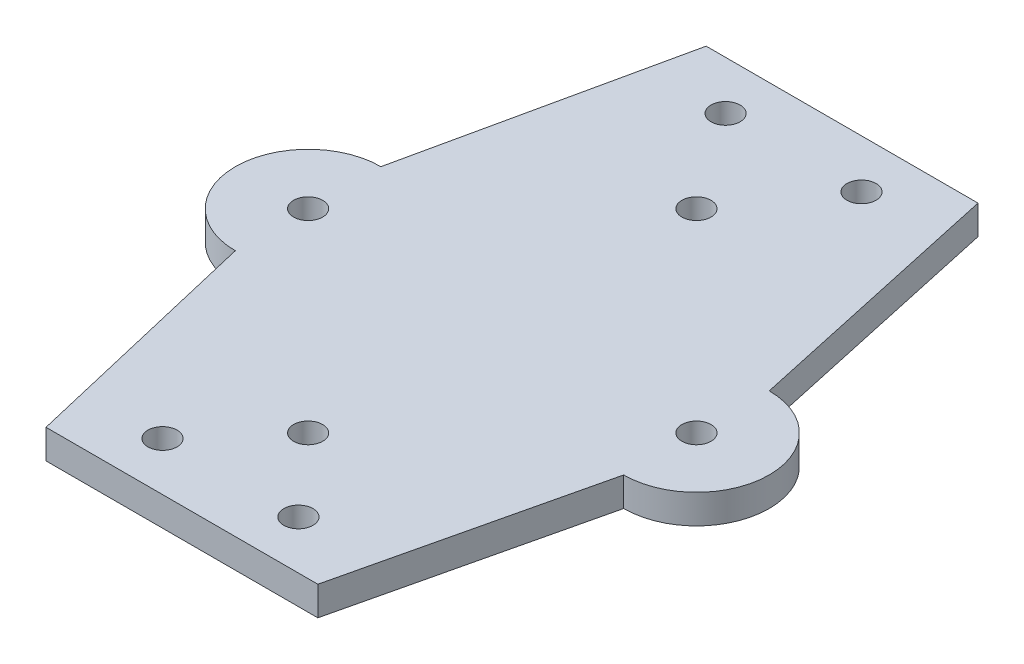
ISO-10303-21;
HEADER;
FILE_DESCRIPTION(('STEP AP214'),'2;1');
FILE_NAME('part.step','',(''),(''),'','','');
FILE_SCHEMA(('AUTOMOTIVE_DESIGN { 1 0 10303 214 1 1 1 1 }'));
ENDSEC;
DATA;
#1=APPLICATION_CONTEXT('core data for automotive mechanical design processes');
#2=APPLICATION_PROTOCOL_DEFINITION('international standard','automotive_design',2000,#1);
#3=PRODUCT_CONTEXT('',#1,'mechanical');
#4=PRODUCT('Part','Part','',(#3));
#5=PRODUCT_RELATED_PRODUCT_CATEGORY('part','',(#4));
#6=PRODUCT_DEFINITION_FORMATION('','',#4);
#7=PRODUCT_DEFINITION_CONTEXT('part definition',#1,'design');
#8=PRODUCT_DEFINITION('design','',#6,#7);
#9=PRODUCT_DEFINITION_SHAPE('','',#8);
#10=(LENGTH_UNIT() NAMED_UNIT(*) SI_UNIT(.MILLI.,.METRE.));
#11=(NAMED_UNIT(*) PLANE_ANGLE_UNIT() SI_UNIT($,.RADIAN.));
#12=(NAMED_UNIT(*) SI_UNIT($,.STERADIAN.) SOLID_ANGLE_UNIT());
#13=UNCERTAINTY_MEASURE_WITH_UNIT(LENGTH_MEASURE(1.E-05),#10,'distance_accuracy_value','');
#14=(GEOMETRIC_REPRESENTATION_CONTEXT(3) GLOBAL_UNCERTAINTY_ASSIGNED_CONTEXT((#13)) GLOBAL_UNIT_ASSIGNED_CONTEXT((#10,
#11,#12)) REPRESENTATION_CONTEXT('',''));
#15=CARTESIAN_POINT('',(0.,0.,0.));
#16=DIRECTION('',(0.,0.,1.));
#17=DIRECTION('',(1.,0.,0.));
#18=AXIS2_PLACEMENT_3D('',#15,#16,#17);
#19=CARTESIAN_POINT('',(20.653202903124,-1.5,-4.50615336068161));
#20=DIRECTION('',(0.977015761409992,0.,-0.213167075216726));
#21=DIRECTION('',(-0.213167075216726,0.,-0.977015761409992));
#22=AXIS2_PLACEMENT_3D('',#19,#20,#21);
#23=PLANE('',#22);
#24=DIRECTION('',(0.,1.,0.));
#25=VECTOR('',#24,1.);
#26=CARTESIAN_POINT('',(14.,-1.5,-35.));
#27=LINE('',#26,#25);
#28=CARTESIAN_POINT('',(14.,-1.5,-35.));
#29=VERTEX_POINT('',#28);
#30=CARTESIAN_POINT('',(14.,1.5,-35.));
#31=VERTEX_POINT('',#30);
#32=EDGE_CURVE('E38',#29,#31,#27,.T.);
#33=ORIENTED_EDGE('',*,*,#32,.T.);
#34=DIRECTION('',(-0.213167075216726,0.,-0.977015761409992));
#35=VECTOR('',#34,1.);
#36=CARTESIAN_POINT('',(20.653202903124,1.5,-4.50615336068161));
#37=LINE('',#36,#35);
#38=CARTESIAN_POINT('',(20.,1.5,-7.50000000000001));
#39=VERTEX_POINT('',#38);
#40=EDGE_CURVE('E100',#39,#31,#37,.T.);
#41=ORIENTED_EDGE('',*,*,#40,.F.);
#42=DIRECTION('',(0.,1.,0.));
#43=VECTOR('',#42,1.);
#44=CARTESIAN_POINT('',(20.,-1.5,-7.50000000000001));
#45=LINE('',#44,#43);
#46=CARTESIAN_POINT('',(20.,-1.5,-7.50000000000001));
#47=VERTEX_POINT('',#46);
#48=EDGE_CURVE('E11',#47,#39,#45,.T.);
#49=ORIENTED_EDGE('',*,*,#48,.F.);
#50=DIRECTION('',(-0.213167075216726,0.,-0.977015761409992));
#51=VECTOR('',#50,1.);
#52=CARTESIAN_POINT('',(20.653202903124,-1.5,-4.50615336068161));
#53=LINE('',#52,#51);
#54=EDGE_CURVE('E102',#47,#29,#53,.T.);
#55=ORIENTED_EDGE('',*,*,#54,.T.);
#56=EDGE_LOOP('',(#33,#41,#49,#55));
#57=FACE_BOUND('',#56,.T.);
#58=ADVANCED_FACE('F34',(#57),#23,.T.);
#59=CARTESIAN_POINT('',(20.,-1.5,0.));
#60=DIRECTION('',(0.,1.,0.));
#61=DIRECTION('',(0.,0.,1.));
#62=AXIS2_PLACEMENT_3D('',#59,#60,#61);
#63=CYLINDRICAL_SURFACE('',#62,7.5);
#64=ORIENTED_EDGE('',*,*,#48,.T.);
#65=CARTESIAN_POINT('',(20.,1.5,0.));
#66=DIRECTION('',(0.,1.,0.));
#67=DIRECTION('',(0.,0.,1.));
#68=AXIS2_PLACEMENT_3D('',#65,#66,#67);
#69=CIRCLE('',#68,7.5);
#70=CARTESIAN_POINT('',(20.,1.5,7.49999999999999));
#71=VERTEX_POINT('',#70);
#72=EDGE_CURVE('E116',#39,#71,#69,.F.);
#73=ORIENTED_EDGE('',*,*,#72,.T.);
#74=DIRECTION('',(0.,1.,0.));
#75=VECTOR('',#74,1.);
#76=CARTESIAN_POINT('',(20.,-1.5,7.49999999999999));
#77=LINE('',#76,#75);
#78=CARTESIAN_POINT('',(20.,-1.5,7.49999999999999));
#79=VERTEX_POINT('',#78);
#80=EDGE_CURVE('E43',#79,#71,#77,.T.);
#81=ORIENTED_EDGE('',*,*,#80,.F.);
#82=CARTESIAN_POINT('',(20.,-1.5,0.));
#83=DIRECTION('',(0.,1.,0.));
#84=DIRECTION('',(0.,0.,1.));
#85=AXIS2_PLACEMENT_3D('',#82,#83,#84);
#86=CIRCLE('',#85,7.5);
#87=EDGE_CURVE('E56',#47,#79,#86,.F.);
#88=ORIENTED_EDGE('',*,*,#87,.F.);
#89=EDGE_LOOP('',(#64,#73,#81,#88));
#90=FACE_BOUND('',#89,.T.);
#91=ADVANCED_FACE('F224',(#90),#63,.T.);
#92=CARTESIAN_POINT('',(20.6229508196721,-1.5,4.85245901639344));
#93=DIRECTION('',(0.973417168333576,0.,0.229039333725547));
#94=DIRECTION('',(0.229039333725547,0.,-0.973417168333576));
#95=AXIS2_PLACEMENT_3D('',#92,#93,#94);
#96=PLANE('',#95);
#97=ORIENTED_EDGE('',*,*,#80,.T.);
#98=DIRECTION('',(0.229039333725547,0.,-0.973417168333576));
#99=VECTOR('',#98,1.);
#100=CARTESIAN_POINT('',(20.6229508196721,1.5,4.85245901639344));
#101=LINE('',#100,#99);
#102=CARTESIAN_POINT('',(14.,1.5,33.));
#103=VERTEX_POINT('',#102);
#104=EDGE_CURVE('E135',#103,#71,#101,.T.);
#105=ORIENTED_EDGE('',*,*,#104,.F.);
#106=DIRECTION('',(0.,1.,0.));
#107=VECTOR('',#106,1.);
#108=CARTESIAN_POINT('',(14.,-1.5,33.));
#109=LINE('',#108,#107);
#110=CARTESIAN_POINT('',(14.,-1.5,33.));
#111=VERTEX_POINT('',#110);
#112=EDGE_CURVE('E198',#111,#103,#109,.T.);
#113=ORIENTED_EDGE('',*,*,#112,.F.);
#114=DIRECTION('',(0.229039333725547,0.,-0.973417168333576));
#115=VECTOR('',#114,1.);
#116=CARTESIAN_POINT('',(20.6229508196721,-1.5,4.85245901639344));
#117=LINE('',#116,#115);
#118=EDGE_CURVE('E176',#111,#79,#117,.T.);
#119=ORIENTED_EDGE('',*,*,#118,.T.);
#120=EDGE_LOOP('',(#97,#105,#113,#119));
#121=FACE_BOUND('',#120,.T.);
#122=ADVANCED_FACE('F227',(#121),#96,.T.);
#123=CARTESIAN_POINT('',(0.,-1.5,33.));
#124=DIRECTION('',(0.,0.,-1.));
#125=DIRECTION('',(-1.,0.,0.));
#126=AXIS2_PLACEMENT_3D('',#123,#124,#125);
#127=PLANE('',#126);
#128=ORIENTED_EDGE('',*,*,#112,.T.);
#129=DIRECTION('',(-1.,0.,0.));
#130=VECTOR('',#129,1.);
#131=CARTESIAN_POINT('',(0.,1.5,33.));
#132=LINE('',#131,#130);
#133=CARTESIAN_POINT('',(-14.,1.5,33.));
#134=VERTEX_POINT('',#133);
#135=EDGE_CURVE('E132',#103,#134,#132,.T.);
#136=ORIENTED_EDGE('',*,*,#135,.T.);
#137=DIRECTION('',(0.,1.,0.));
#138=VECTOR('',#137,1.);
#139=CARTESIAN_POINT('',(-14.,-1.5,33.));
#140=LINE('',#139,#138);
#141=CARTESIAN_POINT('',(-14.,-1.5,33.));
#142=VERTEX_POINT('',#141);
#143=EDGE_CURVE('E200',#142,#134,#140,.T.);
#144=ORIENTED_EDGE('',*,*,#143,.F.);
#145=DIRECTION('',(-1.,0.,0.));
#146=VECTOR('',#145,1.);
#147=CARTESIAN_POINT('',(0.,-1.5,33.));
#148=LINE('',#147,#146);
#149=EDGE_CURVE('E173',#111,#142,#148,.T.);
#150=ORIENTED_EDGE('',*,*,#149,.F.);
#151=EDGE_LOOP('',(#128,#136,#144,#150));
#152=FACE_BOUND('',#151,.T.);
#153=ADVANCED_FACE('F220',(#152),#127,.F.);
#154=CARTESIAN_POINT('',(-20.6229508196721,-1.5,4.85245901639345));
#155=DIRECTION('',(0.973417168333576,0.,-0.229039333725547));
#156=DIRECTION('',(-0.229039333725547,0.,-0.973417168333576));
#157=AXIS2_PLACEMENT_3D('',#154,#155,#156);
#158=PLANE('',#157);
#159=ORIENTED_EDGE('',*,*,#143,.T.);
#160=DIRECTION('',(-0.229039333725547,0.,-0.973417168333576));
#161=VECTOR('',#160,1.);
#162=CARTESIAN_POINT('',(-20.6229508196721,1.5,4.85245901639345));
#163=LINE('',#162,#161);
#164=CARTESIAN_POINT('',(-20.,1.5,7.5));
#165=VERTEX_POINT('',#164);
#166=EDGE_CURVE('E129',#134,#165,#163,.T.);
#167=ORIENTED_EDGE('',*,*,#166,.T.);
#168=DIRECTION('',(0.,1.,0.));
#169=VECTOR('',#168,1.);
#170=CARTESIAN_POINT('',(-20.,-1.5,7.5));
#171=LINE('',#170,#169);
#172=CARTESIAN_POINT('',(-20.,-1.5,7.5));
#173=VERTEX_POINT('',#172);
#174=EDGE_CURVE('E202',#173,#165,#171,.T.);
#175=ORIENTED_EDGE('',*,*,#174,.F.);
#176=DIRECTION('',(-0.229039333725547,0.,-0.973417168333576));
#177=VECTOR('',#176,1.);
#178=CARTESIAN_POINT('',(-20.6229508196721,-1.5,4.85245901639345));
#179=LINE('',#178,#177);
#180=EDGE_CURVE('E171',#142,#173,#179,.T.);
#181=ORIENTED_EDGE('',*,*,#180,.F.);
#182=EDGE_LOOP('',(#159,#167,#175,#181));
#183=FACE_BOUND('',#182,.T.);
#184=ADVANCED_FACE('F216',(#183),#158,.F.);
#185=CARTESIAN_POINT('',(-20.,-1.5,0.));
#186=DIRECTION('',(0.,1.,0.));
#187=DIRECTION('',(0.,0.,1.));
#188=AXIS2_PLACEMENT_3D('',#185,#186,#187);
#189=CYLINDRICAL_SURFACE('',#188,7.5);
#190=ORIENTED_EDGE('',*,*,#174,.T.);
#191=CARTESIAN_POINT('',(-20.,1.5,0.));
#192=DIRECTION('',(0.,1.,0.));
#193=DIRECTION('',(0.,0.,1.));
#194=AXIS2_PLACEMENT_3D('',#191,#192,#193);
#195=CIRCLE('',#194,7.5);
#196=CARTESIAN_POINT('',(-20.,1.5,-7.5));
#197=VERTEX_POINT('',#196);
#198=EDGE_CURVE('E123',#197,#165,#195,.T.);
#199=ORIENTED_EDGE('',*,*,#198,.F.);
#200=DIRECTION('',(0.,1.,0.));
#201=VECTOR('',#200,1.);
#202=CARTESIAN_POINT('',(-20.,-1.5,-7.5));
#203=LINE('',#202,#201);
#204=CARTESIAN_POINT('',(-20.,-1.5,-7.5));
#205=VERTEX_POINT('',#204);
#206=EDGE_CURVE('E204',#205,#197,#203,.T.);
#207=ORIENTED_EDGE('',*,*,#206,.F.);
#208=CARTESIAN_POINT('',(-20.,-1.5,0.));
#209=DIRECTION('',(0.,1.,0.));
#210=DIRECTION('',(0.,0.,1.));
#211=AXIS2_PLACEMENT_3D('',#208,#209,#210);
#212=CIRCLE('',#211,7.5);
#213=EDGE_CURVE('E168',#205,#173,#212,.T.);
#214=ORIENTED_EDGE('',*,*,#213,.T.);
#215=EDGE_LOOP('',(#190,#199,#207,#214));
#216=FACE_BOUND('',#215,.T.);
#217=ADVANCED_FACE('F211',(#216),#189,.T.);
#218=CARTESIAN_POINT('',(-20.653202903124,-1.5,-4.50615336068161));
#219=DIRECTION('',(0.977015761409992,0.,0.213167075216726));
#220=DIRECTION('',(0.213167075216726,0.,-0.977015761409992));
#221=AXIS2_PLACEMENT_3D('',#218,#219,#220);
#222=PLANE('',#221);
#223=ORIENTED_EDGE('',*,*,#206,.T.);
#224=DIRECTION('',(0.213167075216726,0.,-0.977015761409992));
#225=VECTOR('',#224,1.);
#226=CARTESIAN_POINT('',(-20.653202903124,1.5,-4.50615336068161));
#227=LINE('',#226,#225);
#228=CARTESIAN_POINT('',(-14.,1.5,-35.));
#229=VERTEX_POINT('',#228);
#230=EDGE_CURVE('E121',#197,#229,#227,.T.);
#231=ORIENTED_EDGE('',*,*,#230,.T.);
#232=DIRECTION('',(0.,1.,0.));
#233=VECTOR('',#232,1.);
#234=CARTESIAN_POINT('',(-14.,-1.5,-35.));
#235=LINE('',#234,#233);
#236=CARTESIAN_POINT('',(-14.,-1.5,-35.));
#237=VERTEX_POINT('',#236);
#238=EDGE_CURVE('E105',#237,#229,#235,.T.);
#239=ORIENTED_EDGE('',*,*,#238,.F.);
#240=DIRECTION('',(0.213167075216726,0.,-0.977015761409992));
#241=VECTOR('',#240,1.);
#242=CARTESIAN_POINT('',(-20.653202903124,-1.5,-4.50615336068161));
#243=LINE('',#242,#241);
#244=EDGE_CURVE('E165',#205,#237,#243,.T.);
#245=ORIENTED_EDGE('',*,*,#244,.F.);
#246=EDGE_LOOP('',(#223,#231,#239,#245));
#247=FACE_BOUND('',#246,.T.);
#248=ADVANCED_FACE('F208',(#247),#222,.F.);
#249=CARTESIAN_POINT('',(-20.,-1.5,0.));
#250=DIRECTION('',(0.,1.,0.));
#251=DIRECTION('',(0.,0.,1.));
#252=AXIS2_PLACEMENT_3D('',#249,#250,#251);
#253=CYLINDRICAL_SURFACE('',#252,1.5);
#254=CARTESIAN_POINT('',(-20.,-1.5,0.));
#255=DIRECTION('',(0.,1.,0.));
#256=DIRECTION('',(0.,0.,1.));
#257=AXIS2_PLACEMENT_3D('',#254,#255,#256);
#258=CIRCLE('',#257,1.5);
#259=CARTESIAN_POINT('',(-20.,-1.5,1.5));
#260=VERTEX_POINT('',#259);
#261=EDGE_CURVE('E192',#260,#260,#258,.T.);
#262=ORIENTED_EDGE('',*,*,#261,.F.);
#263=EDGE_LOOP('',(#262));
#264=FACE_BOUND('',#263,.T.);
#265=CARTESIAN_POINT('',(-20.,1.5,0.));
#266=DIRECTION('',(0.,1.,0.));
#267=DIRECTION('',(0.,0.,1.));
#268=AXIS2_PLACEMENT_3D('',#265,#266,#267);
#269=CIRCLE('',#268,1.5);
#270=CARTESIAN_POINT('',(-20.,1.5,1.5));
#271=VERTEX_POINT('',#270);
#272=EDGE_CURVE('E150',#271,#271,#269,.T.);
#273=ORIENTED_EDGE('',*,*,#272,.T.);
#274=EDGE_LOOP('',(#273));
#275=FACE_BOUND('',#274,.T.);
#276=ADVANCED_FACE('F274',(#264,#275),#253,.F.);
#277=CARTESIAN_POINT('',(7.,-1.5,-30.));
#278=DIRECTION('',(0.,1.,0.));
#279=DIRECTION('',(0.,0.,1.));
#280=AXIS2_PLACEMENT_3D('',#277,#278,#279);
#281=CYLINDRICAL_SURFACE('',#280,1.5);
#282=CARTESIAN_POINT('',(7.,-1.5,-30.));
#283=DIRECTION('',(0.,1.,0.));
#284=DIRECTION('',(0.,0.,1.));
#285=AXIS2_PLACEMENT_3D('',#282,#283,#284);
#286=CIRCLE('',#285,1.5);
#287=CARTESIAN_POINT('',(7.,-1.5,-28.5));
#288=VERTEX_POINT('',#287);
#289=EDGE_CURVE('E189',#288,#288,#286,.F.);
#290=ORIENTED_EDGE('',*,*,#289,.T.);
#291=EDGE_LOOP('',(#290));
#292=FACE_BOUND('',#291,.T.);
#293=CARTESIAN_POINT('',(7.,1.5,-30.));
#294=DIRECTION('',(0.,1.,0.));
#295=DIRECTION('',(0.,0.,1.));
#296=AXIS2_PLACEMENT_3D('',#293,#294,#295);
#297=CIRCLE('',#296,1.5);
#298=CARTESIAN_POINT('',(7.,1.5,-28.5));
#299=VERTEX_POINT('',#298);
#300=EDGE_CURVE('E147',#299,#299,#297,.F.);
#301=ORIENTED_EDGE('',*,*,#300,.F.);
#302=EDGE_LOOP('',(#301));
#303=FACE_BOUND('',#302,.T.);
#304=ADVANCED_FACE('F277',(#292,#303),#281,.F.);
#305=CARTESIAN_POINT('',(7.00000000000002,-1.5,28.));
#306=DIRECTION('',(0.,1.,0.));
#307=DIRECTION('',(0.,0.,1.));
#308=AXIS2_PLACEMENT_3D('',#305,#306,#307);
#309=CYLINDRICAL_SURFACE('',#308,1.5);
#310=CARTESIAN_POINT('',(7.00000000000002,-1.5,28.));
#311=DIRECTION('',(0.,1.,0.));
#312=DIRECTION('',(0.,0.,1.));
#313=AXIS2_PLACEMENT_3D('',#310,#311,#312);
#314=CIRCLE('',#313,1.5);
#315=CARTESIAN_POINT('',(7.00000000000002,-1.5,29.5));
#316=VERTEX_POINT('',#315);
#317=EDGE_CURVE('E186',#316,#316,#314,.F.);
#318=ORIENTED_EDGE('',*,*,#317,.T.);
#319=EDGE_LOOP('',(#318));
#320=FACE_BOUND('',#319,.T.);
#321=CARTESIAN_POINT('',(7.00000000000002,1.5,28.));
#322=DIRECTION('',(0.,1.,0.));
#323=DIRECTION('',(0.,0.,1.));
#324=AXIS2_PLACEMENT_3D('',#321,#322,#323);
#325=CIRCLE('',#324,1.5);
#326=CARTESIAN_POINT('',(7.00000000000002,1.5,29.5));
#327=VERTEX_POINT('',#326);
#328=EDGE_CURVE('E144',#327,#327,#325,.F.);
#329=ORIENTED_EDGE('',*,*,#328,.F.);
#330=EDGE_LOOP('',(#329));
#331=FACE_BOUND('',#330,.T.);
#332=ADVANCED_FACE('F281',(#320,#331),#309,.F.);
#333=CARTESIAN_POINT('',(-7.,-1.5,-30.));
#334=DIRECTION('',(0.,1.,0.));
#335=DIRECTION('',(0.,0.,1.));
#336=AXIS2_PLACEMENT_3D('',#333,#334,#335);
#337=CYLINDRICAL_SURFACE('',#336,1.5);
#338=CARTESIAN_POINT('',(-7.,-1.5,-30.));
#339=DIRECTION('',(0.,1.,0.));
#340=DIRECTION('',(0.,0.,1.));
#341=AXIS2_PLACEMENT_3D('',#338,#339,#340);
#342=CIRCLE('',#341,1.5);
#343=CARTESIAN_POINT('',(-7.,-1.5,-28.5));
#344=VERTEX_POINT('',#343);
#345=EDGE_CURVE('E183',#344,#344,#342,.T.);
#346=ORIENTED_EDGE('',*,*,#345,.F.);
#347=EDGE_LOOP('',(#346));
#348=FACE_BOUND('',#347,.T.);
#349=CARTESIAN_POINT('',(-7.,1.5,-30.));
#350=DIRECTION('',(0.,1.,0.));
#351=DIRECTION('',(0.,0.,1.));
#352=AXIS2_PLACEMENT_3D('',#349,#350,#351);
#353=CIRCLE('',#352,1.5);
#354=CARTESIAN_POINT('',(-7.,1.5,-28.5));
#355=VERTEX_POINT('',#354);
#356=EDGE_CURVE('E141',#355,#355,#353,.T.);
#357=ORIENTED_EDGE('',*,*,#356,.T.);
#358=EDGE_LOOP('',(#357));
#359=FACE_BOUND('',#358,.T.);
#360=ADVANCED_FACE('F285',(#348,#359),#337,.F.);
#361=CARTESIAN_POINT('',(-7.,-1.5,28.));
#362=DIRECTION('',(0.,1.,0.));
#363=DIRECTION('',(0.,0.,1.));
#364=AXIS2_PLACEMENT_3D('',#361,#362,#363);
#365=CYLINDRICAL_SURFACE('',#364,1.5);
#366=CARTESIAN_POINT('',(-7.,-1.5,28.));
#367=DIRECTION('',(0.,1.,0.));
#368=DIRECTION('',(0.,0.,1.));
#369=AXIS2_PLACEMENT_3D('',#366,#367,#368);
#370=CIRCLE('',#369,1.5);
#371=CARTESIAN_POINT('',(-7.,-1.5,29.5));
#372=VERTEX_POINT('',#371);
#373=EDGE_CURVE('E180',#372,#372,#370,.T.);
#374=ORIENTED_EDGE('',*,*,#373,.F.);
#375=EDGE_LOOP('',(#374));
#376=FACE_BOUND('',#375,.T.);
#377=CARTESIAN_POINT('',(-7.,1.5,28.));
#378=DIRECTION('',(0.,1.,0.));
#379=DIRECTION('',(0.,0.,1.));
#380=AXIS2_PLACEMENT_3D('',#377,#378,#379);
#381=CIRCLE('',#380,1.5);
#382=CARTESIAN_POINT('',(-7.,1.5,29.5));
#383=VERTEX_POINT('',#382);
#384=EDGE_CURVE('E138',#383,#383,#381,.T.);
#385=ORIENTED_EDGE('',*,*,#384,.T.);
#386=EDGE_LOOP('',(#385));
#387=FACE_BOUND('',#386,.T.);
#388=ADVANCED_FACE('F251',(#376,#387),#365,.F.);
#389=CARTESIAN_POINT('',(0.,-1.5,-35.));
#390=DIRECTION('',(0.,0.,1.));
#391=DIRECTION('',(1.,0.,0.));
#392=AXIS2_PLACEMENT_3D('',#389,#390,#391);
#393=PLANE('',#392);
#394=ORIENTED_EDGE('',*,*,#238,.T.);
#395=DIRECTION('',(1.,0.,0.));
#396=VECTOR('',#395,1.);
#397=CARTESIAN_POINT('',(0.,1.5,-35.));
#398=LINE('',#397,#396);
#399=EDGE_CURVE('E112',#229,#31,#398,.T.);
#400=ORIENTED_EDGE('',*,*,#399,.T.);
#401=ORIENTED_EDGE('',*,*,#32,.F.);
#402=DIRECTION('',(1.,0.,0.));
#403=VECTOR('',#402,1.);
#404=CARTESIAN_POINT('',(0.,-1.5,-35.));
#405=LINE('',#404,#403);
#406=EDGE_CURVE('E163',#237,#29,#405,.T.);
#407=ORIENTED_EDGE('',*,*,#406,.F.);
#408=EDGE_LOOP('',(#394,#400,#401,#407));
#409=FACE_BOUND('',#408,.T.);
#410=ADVANCED_FACE('F119',(#409),#393,.F.);
#411=CARTESIAN_POINT('',(0.,-1.5,-20.));
#412=DIRECTION('',(0.,1.,0.));
#413=DIRECTION('',(0.,0.,1.));
#414=AXIS2_PLACEMENT_3D('',#411,#412,#413);
#415=CYLINDRICAL_SURFACE('',#414,1.5);
#416=CARTESIAN_POINT('',(0.,-1.5,-20.));
#417=DIRECTION('',(0.,1.,0.));
#418=DIRECTION('',(0.,0.,1.));
#419=AXIS2_PLACEMENT_3D('',#416,#417,#418);
#420=CIRCLE('',#419,1.5);
#421=CARTESIAN_POINT('',(0.,-1.5,-18.5));
#422=VERTEX_POINT('',#421);
#423=EDGE_CURVE('E159',#422,#422,#420,.T.);
#424=ORIENTED_EDGE('',*,*,#423,.F.);
#425=EDGE_LOOP('',(#424));
#426=FACE_BOUND('',#425,.T.);
#427=CARTESIAN_POINT('',(0.,1.5,-20.));
#428=DIRECTION('',(0.,1.,0.));
#429=DIRECTION('',(0.,0.,1.));
#430=AXIS2_PLACEMENT_3D('',#427,#428,#429);
#431=CIRCLE('',#430,1.5);
#432=CARTESIAN_POINT('',(0.,1.5,-18.5));
#433=VERTEX_POINT('',#432);
#434=EDGE_CURVE('E117',#433,#433,#431,.T.);
#435=ORIENTED_EDGE('',*,*,#434,.T.);
#436=EDGE_LOOP('',(#435));
#437=FACE_BOUND('',#436,.T.);
#438=ADVANCED_FACE('F242',(#426,#437),#415,.F.);
#439=CARTESIAN_POINT('',(0.,-1.5,20.));
#440=DIRECTION('',(0.,1.,0.));
#441=DIRECTION('',(0.,0.,1.));
#442=AXIS2_PLACEMENT_3D('',#439,#440,#441);
#443=CYLINDRICAL_SURFACE('',#442,1.5);
#444=CARTESIAN_POINT('',(0.,-1.5,20.));
#445=DIRECTION('',(0.,1.,0.));
#446=DIRECTION('',(0.,0.,1.));
#447=AXIS2_PLACEMENT_3D('',#444,#445,#446);
#448=CIRCLE('',#447,1.5);
#449=CARTESIAN_POINT('',(0.,-1.5,21.5));
#450=VERTEX_POINT('',#449);
#451=EDGE_CURVE('E156',#450,#450,#448,.T.);
#452=ORIENTED_EDGE('',*,*,#451,.F.);
#453=EDGE_LOOP('',(#452));
#454=FACE_BOUND('',#453,.T.);
#455=CARTESIAN_POINT('',(0.,1.5,20.));
#456=DIRECTION('',(0.,1.,0.));
#457=DIRECTION('',(0.,0.,1.));
#458=AXIS2_PLACEMENT_3D('',#455,#456,#457);
#459=CIRCLE('',#458,1.5);
#460=CARTESIAN_POINT('',(0.,1.5,21.5));
#461=VERTEX_POINT('',#460);
#462=EDGE_CURVE('E257',#461,#461,#459,.T.);
#463=ORIENTED_EDGE('',*,*,#462,.T.);
#464=EDGE_LOOP('',(#463));
#465=FACE_BOUND('',#464,.T.);
#466=ADVANCED_FACE('F36',(#454,#465),#443,.F.);
#467=CARTESIAN_POINT('',(20.,-1.5,0.));
#468=DIRECTION('',(0.,1.,0.));
#469=DIRECTION('',(0.,0.,1.));
#470=AXIS2_PLACEMENT_3D('',#467,#468,#469);
#471=CYLINDRICAL_SURFACE('',#470,1.5);
#472=CARTESIAN_POINT('',(20.,-1.5,0.));
#473=DIRECTION('',(0.,1.,0.));
#474=DIRECTION('',(0.,0.,1.));
#475=AXIS2_PLACEMENT_3D('',#472,#473,#474);
#476=CIRCLE('',#475,1.5);
#477=CARTESIAN_POINT('',(20.,-1.5,1.5));
#478=VERTEX_POINT('',#477);
#479=EDGE_CURVE('E106',#478,#478,#476,.F.);
#480=ORIENTED_EDGE('',*,*,#479,.T.);
#481=EDGE_LOOP('',(#480));
#482=FACE_BOUND('',#481,.T.);
#483=CARTESIAN_POINT('',(20.,1.5,0.));
#484=DIRECTION('',(0.,1.,0.));
#485=DIRECTION('',(0.,0.,1.));
#486=AXIS2_PLACEMENT_3D('',#483,#484,#485);
#487=CIRCLE('',#486,1.5);
#488=CARTESIAN_POINT('',(20.,1.5,1.5));
#489=VERTEX_POINT('',#488);
#490=EDGE_CURVE('E153',#489,#489,#487,.F.);
#491=ORIENTED_EDGE('',*,*,#490,.F.);
#492=EDGE_LOOP('',(#491));
#493=FACE_BOUND('',#492,.T.);
#494=ADVANCED_FACE('F249',(#482,#493),#471,.F.);
#495=CARTESIAN_POINT('',(0.,-1.5,0.));
#496=DIRECTION('',(0.,1.,0.));
#497=DIRECTION('',(0.,0.,1.));
#498=AXIS2_PLACEMENT_3D('',#495,#496,#497);
#499=PLANE('',#498);
#500=ORIENTED_EDGE('',*,*,#451,.T.);
#501=EDGE_LOOP('',(#500));
#502=FACE_BOUND('',#501,.T.);
#503=ORIENTED_EDGE('',*,*,#423,.T.);
#504=EDGE_LOOP('',(#503));
#505=FACE_BOUND('',#504,.T.);
#506=ORIENTED_EDGE('',*,*,#54,.F.);
#507=ORIENTED_EDGE('',*,*,#87,.T.);
#508=ORIENTED_EDGE('',*,*,#118,.F.);
#509=ORIENTED_EDGE('',*,*,#149,.T.);
#510=ORIENTED_EDGE('',*,*,#180,.T.);
#511=ORIENTED_EDGE('',*,*,#213,.F.);
#512=ORIENTED_EDGE('',*,*,#244,.T.);
#513=ORIENTED_EDGE('',*,*,#406,.T.);
#514=EDGE_LOOP('',(#506,#507,#508,#509,#510,#511,#512,#513));
#515=FACE_BOUND('',#514,.T.);
#516=ORIENTED_EDGE('',*,*,#373,.T.);
#517=EDGE_LOOP('',(#516));
#518=FACE_BOUND('',#517,.T.);
#519=ORIENTED_EDGE('',*,*,#345,.T.);
#520=EDGE_LOOP('',(#519));
#521=FACE_BOUND('',#520,.T.);
#522=ORIENTED_EDGE('',*,*,#317,.F.);
#523=EDGE_LOOP('',(#522));
#524=FACE_BOUND('',#523,.T.);
#525=ORIENTED_EDGE('',*,*,#289,.F.);
#526=EDGE_LOOP('',(#525));
#527=FACE_BOUND('',#526,.T.);
#528=ORIENTED_EDGE('',*,*,#261,.T.);
#529=EDGE_LOOP('',(#528));
#530=FACE_BOUND('',#529,.T.);
#531=ORIENTED_EDGE('',*,*,#479,.F.);
#532=EDGE_LOOP('',(#531));
#533=FACE_BOUND('',#532,.T.);
#534=ADVANCED_FACE('F225',(#502,#505,#515,#518,#521,#524,#527,#530,#533),#499,.F.);
#535=CARTESIAN_POINT('',(0.,1.5,0.));
#536=DIRECTION('',(0.,1.,0.));
#537=DIRECTION('',(0.,0.,1.));
#538=AXIS2_PLACEMENT_3D('',#535,#536,#537);
#539=PLANE('',#538);
#540=ORIENTED_EDGE('',*,*,#462,.F.);
#541=EDGE_LOOP('',(#540));
#542=FACE_BOUND('',#541,.T.);
#543=ORIENTED_EDGE('',*,*,#434,.F.);
#544=EDGE_LOOP('',(#543));
#545=FACE_BOUND('',#544,.T.);
#546=ORIENTED_EDGE('',*,*,#40,.T.);
#547=ORIENTED_EDGE('',*,*,#399,.F.);
#548=ORIENTED_EDGE('',*,*,#230,.F.);
#549=ORIENTED_EDGE('',*,*,#198,.T.);
#550=ORIENTED_EDGE('',*,*,#166,.F.);
#551=ORIENTED_EDGE('',*,*,#135,.F.);
#552=ORIENTED_EDGE('',*,*,#104,.T.);
#553=ORIENTED_EDGE('',*,*,#72,.F.);
#554=EDGE_LOOP('',(#546,#547,#548,#549,#550,#551,#552,#553));
#555=FACE_BOUND('',#554,.T.);
#556=ORIENTED_EDGE('',*,*,#384,.F.);
#557=EDGE_LOOP('',(#556));
#558=FACE_BOUND('',#557,.T.);
#559=ORIENTED_EDGE('',*,*,#356,.F.);
#560=EDGE_LOOP('',(#559));
#561=FACE_BOUND('',#560,.T.);
#562=ORIENTED_EDGE('',*,*,#328,.T.);
#563=EDGE_LOOP('',(#562));
#564=FACE_BOUND('',#563,.T.);
#565=ORIENTED_EDGE('',*,*,#300,.T.);
#566=EDGE_LOOP('',(#565));
#567=FACE_BOUND('',#566,.T.);
#568=ORIENTED_EDGE('',*,*,#272,.F.);
#569=EDGE_LOOP('',(#568));
#570=FACE_BOUND('',#569,.T.);
#571=ORIENTED_EDGE('',*,*,#490,.T.);
#572=EDGE_LOOP('',(#571));
#573=FACE_BOUND('',#572,.T.);
#574=ADVANCED_FACE('F109',(#542,#545,#555,#558,#561,#564,#567,#570,#573),#539,.T.);
#575=CLOSED_SHELL('',(#58,#91,#122,#153,#184,#217,#248,#276,#304,#332,#360,#388,#410,#438,#466,
#494,#534,#574));
#576=MANIFOLD_SOLID_BREP('B2',#575);
#577=ADVANCED_BREP_SHAPE_REPRESENTATION('',(#18,#576),#14);
#578=SHAPE_DEFINITION_REPRESENTATION(#9,#577);
ENDSEC;
END-ISO-10303-21;
